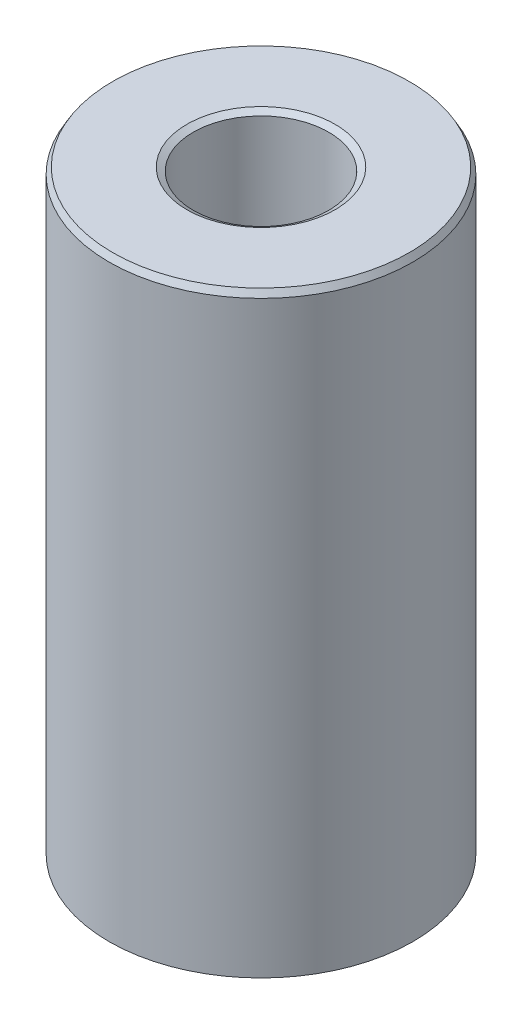
ISO-10303-21;
HEADER;
FILE_DESCRIPTION(('STEP AP214'),'2;1');
FILE_NAME('part.step','',(''),(''),'','','');
FILE_SCHEMA(('AUTOMOTIVE_DESIGN { 1 0 10303 214 1 1 1 1 }'));
ENDSEC;
DATA;
#1=APPLICATION_CONTEXT('core data for automotive mechanical design processes');
#2=APPLICATION_PROTOCOL_DEFINITION('international standard','automotive_design',2000,#1);
#3=PRODUCT_CONTEXT('',#1,'mechanical');
#4=PRODUCT('Part','Part','',(#3));
#5=PRODUCT_RELATED_PRODUCT_CATEGORY('part','',(#4));
#6=PRODUCT_DEFINITION_FORMATION('','',#4);
#7=PRODUCT_DEFINITION_CONTEXT('part definition',#1,'design');
#8=PRODUCT_DEFINITION('design','',#6,#7);
#9=PRODUCT_DEFINITION_SHAPE('','',#8);
#10=(LENGTH_UNIT() NAMED_UNIT(*) SI_UNIT(.MILLI.,.METRE.));
#11=(NAMED_UNIT(*) PLANE_ANGLE_UNIT() SI_UNIT($,.RADIAN.));
#12=(NAMED_UNIT(*) SI_UNIT($,.STERADIAN.) SOLID_ANGLE_UNIT());
#13=UNCERTAINTY_MEASURE_WITH_UNIT(LENGTH_MEASURE(1.E-05),#10,'distance_accuracy_value','');
#14=(GEOMETRIC_REPRESENTATION_CONTEXT(3) GLOBAL_UNCERTAINTY_ASSIGNED_CONTEXT((#13)) GLOBAL_UNIT_ASSIGNED_CONTEXT((#10,
#11,#12)) REPRESENTATION_CONTEXT('',''));
#15=CARTESIAN_POINT('',(0.,0.,0.));
#16=DIRECTION('',(0.,0.,1.));
#17=DIRECTION('',(1.,0.,0.));
#18=AXIS2_PLACEMENT_3D('',#15,#16,#17);
#19=CARTESIAN_POINT('',(0.,19.69420867426,0.));
#20=DIRECTION('',(0.,-1.,0.));
#21=DIRECTION('',(0.,0.,-1.));
#22=AXIS2_PLACEMENT_3D('',#19,#20,#21);
#23=CYLINDRICAL_SURFACE('',#22,5.);
#24=CARTESIAN_POINT('',(0.,0.120527176722118,0.));
#25=DIRECTION('',(0.,1.,0.));
#26=DIRECTION('',(0.,0.,1.));
#27=AXIS2_PLACEMENT_3D('',#24,#25,#26);
#28=CIRCLE('',#27,5.);
#29=CARTESIAN_POINT('',(0.,0.120527176722118,5.));
#30=VERTEX_POINT('',#29);
#31=EDGE_CURVE('E10',#30,#30,#28,.T.);
#32=ORIENTED_EDGE('',*,*,#31,.T.);
#33=EDGE_LOOP('',(#32));
#34=FACE_BOUND('',#33,.T.);
#35=CARTESIAN_POINT('',(0.,19.4854494804845,0.));
#36=DIRECTION('',(0.,1.,0.));
#37=DIRECTION('',(0.,0.,1.));
#38=AXIS2_PLACEMENT_3D('',#35,#36,#37);
#39=CIRCLE('',#38,5.);
#40=CARTESIAN_POINT('',(0.,19.4854494804845,5.));
#41=VERTEX_POINT('',#40);
#42=EDGE_CURVE('E50',#41,#41,#39,.F.);
#43=ORIENTED_EDGE('',*,*,#42,.T.);
#44=EDGE_LOOP('',(#43));
#45=FACE_BOUND('',#44,.T.);
#46=ADVANCED_FACE('F39',(#34,#45),#23,.T.);
#47=CARTESIAN_POINT('',(0.,19.69420867426,0.));
#48=DIRECTION('',(0.,1.,0.));
#49=DIRECTION('',(0.,0.,1.));
#50=AXIS2_PLACEMENT_3D('',#47,#48,#49);
#51=PLANE('',#50);
#52=CARTESIAN_POINT('',(0.,19.69420867426,0.));
#53=DIRECTION('',(0.,1.,0.));
#54=DIRECTION('',(0.,0.,1.));
#55=AXIS2_PLACEMENT_3D('',#52,#53,#54);
#56=CIRCLE('',#55,2.43810230074038);
#57=CARTESIAN_POINT('',(0.,19.69420867426,2.43810230074038));
#58=VERTEX_POINT('',#57);
#59=EDGE_CURVE('E58',#58,#58,#56,.F.);
#60=ORIENTED_EDGE('',*,*,#59,.T.);
#61=EDGE_LOOP('',(#60));
#62=FACE_BOUND('',#61,.T.);
#63=CARTESIAN_POINT('',(0.,19.69420867426,0.));
#64=DIRECTION('',(0.,1.,0.));
#65=DIRECTION('',(0.,0.,1.));
#66=AXIS2_PLACEMENT_3D('',#63,#64,#65);
#67=CIRCLE('',#66,4.87947282327788);
#68=CARTESIAN_POINT('',(0.,19.69420867426,4.87947282327788));
#69=VERTEX_POINT('',#68);
#70=EDGE_CURVE('E61',#69,#69,#67,.T.);
#71=ORIENTED_EDGE('',*,*,#70,.T.);
#72=EDGE_LOOP('',(#71));
#73=FACE_BOUND('',#72,.T.);
#74=ADVANCED_FACE('F88',(#62,#73),#51,.T.);
#75=CARTESIAN_POINT('',(0.,0.,0.));
#76=DIRECTION('',(0.,1.,0.));
#77=DIRECTION('',(0.,0.,1.));
#78=AXIS2_PLACEMENT_3D('',#75,#76,#77);
#79=PLANE('',#78);
#80=CARTESIAN_POINT('',(0.,0.,0.));
#81=DIRECTION('',(0.,1.,0.));
#82=DIRECTION('',(0.,0.,1.));
#83=AXIS2_PLACEMENT_3D('',#80,#81,#82);
#84=CIRCLE('',#83,2.34987028368695);
#85=CARTESIAN_POINT('',(0.,0.,2.34987028368695));
#86=VERTEX_POINT('',#85);
#87=EDGE_CURVE('E51',#86,#86,#84,.T.);
#88=ORIENTED_EDGE('',*,*,#87,.T.);
#89=EDGE_LOOP('',(#88));
#90=FACE_BOUND('',#89,.T.);
#91=CARTESIAN_POINT('',(0.,0.,0.));
#92=DIRECTION('',(0.,1.,0.));
#93=DIRECTION('',(0.,0.,1.));
#94=AXIS2_PLACEMENT_3D('',#91,#92,#93);
#95=CIRCLE('',#94,4.79124080622446);
#96=CARTESIAN_POINT('',(0.,0.,4.79124080622446));
#97=VERTEX_POINT('',#96);
#98=EDGE_CURVE('E54',#97,#97,#95,.F.);
#99=ORIENTED_EDGE('',*,*,#98,.T.);
#100=EDGE_LOOP('',(#99));
#101=FACE_BOUND('',#100,.T.);
#102=ADVANCED_FACE('F83',(#90,#101),#79,.F.);
#103=CARTESIAN_POINT('',(0.,19.69420867426,0.));
#104=DIRECTION('',(0.,-1.,0.));
#105=DIRECTION('',(0.,0.,-1.));
#106=AXIS2_PLACEMENT_3D('',#103,#104,#105);
#107=CYLINDRICAL_SURFACE('',#106,2.22934310696483);
#108=CARTESIAN_POINT('',(0.,19.5736814975379,0.));
#109=DIRECTION('',(0.,1.,0.));
#110=DIRECTION('',(0.,0.,1.));
#111=AXIS2_PLACEMENT_3D('',#108,#109,#110);
#112=CIRCLE('',#111,2.22934310696483);
#113=CARTESIAN_POINT('',(0.,19.5736814975379,2.22934310696483));
#114=VERTEX_POINT('',#113);
#115=EDGE_CURVE('E67',#114,#114,#112,.T.);
#116=ORIENTED_EDGE('',*,*,#115,.T.);
#117=EDGE_LOOP('',(#116));
#118=FACE_BOUND('',#117,.T.);
#119=CARTESIAN_POINT('',(0.,0.20875919377554,0.));
#120=DIRECTION('',(0.,1.,0.));
#121=DIRECTION('',(0.,0.,1.));
#122=AXIS2_PLACEMENT_3D('',#119,#120,#121);
#123=CIRCLE('',#122,2.22934310696483);
#124=CARTESIAN_POINT('',(0.,0.20875919377554,2.22934310696483));
#125=VERTEX_POINT('',#124);
#126=EDGE_CURVE('E69',#125,#125,#123,.F.);
#127=ORIENTED_EDGE('',*,*,#126,.T.);
#128=EDGE_LOOP('',(#127));
#129=FACE_BOUND('',#128,.T.);
#130=ADVANCED_FACE('F71',(#118,#129),#107,.F.);
#131=CARTESIAN_POINT('',(0.,19.5736814975379,0.));
#132=DIRECTION('',(0.,1.,0.));
#133=DIRECTION('',(0.,0.,1.));
#134=AXIS2_PLACEMENT_3D('',#131,#132,#133);
#135=CONICAL_SURFACE('',#134,2.22934310696483,1.04719755119661);
#136=ORIENTED_EDGE('',*,*,#59,.F.);
#137=EDGE_LOOP('',(#136));
#138=FACE_BOUND('',#137,.T.);
#139=ORIENTED_EDGE('',*,*,#115,.F.);
#140=EDGE_LOOP('',(#139));
#141=FACE_BOUND('',#140,.T.);
#142=ADVANCED_FACE('F77',(#138,#141),#135,.F.);
#143=CARTESIAN_POINT('',(0.,0.,0.));
#144=DIRECTION('',(0.,-1.,0.));
#145=DIRECTION('',(0.,0.,-1.));
#146=AXIS2_PLACEMENT_3D('',#143,#144,#145);
#147=CONICAL_SURFACE('',#146,2.34987028368695,0.523598775598292);
#148=ORIENTED_EDGE('',*,*,#126,.F.);
#149=EDGE_LOOP('',(#148));
#150=FACE_BOUND('',#149,.T.);
#151=ORIENTED_EDGE('',*,*,#87,.F.);
#152=EDGE_LOOP('',(#151));
#153=FACE_BOUND('',#152,.T.);
#154=ADVANCED_FACE('F73',(#150,#153),#147,.F.);
#155=CARTESIAN_POINT('',(0.,0.120527176722118,0.));
#156=DIRECTION('',(0.,1.,0.));
#157=DIRECTION('',(0.,0.,1.));
#158=AXIS2_PLACEMENT_3D('',#155,#156,#157);
#159=CONICAL_SURFACE('',#158,5.,1.04719755119659);
#160=ORIENTED_EDGE('',*,*,#98,.F.);
#161=EDGE_LOOP('',(#160));
#162=FACE_BOUND('',#161,.T.);
#163=ORIENTED_EDGE('',*,*,#31,.F.);
#164=EDGE_LOOP('',(#163));
#165=FACE_BOUND('',#164,.T.);
#166=ADVANCED_FACE('F76',(#162,#165),#159,.T.);
#167=CARTESIAN_POINT('',(0.,19.69420867426,0.));
#168=DIRECTION('',(0.,-1.,0.));
#169=DIRECTION('',(0.,0.,-1.));
#170=AXIS2_PLACEMENT_3D('',#167,#168,#169);
#171=CONICAL_SURFACE('',#170,4.87947282327788,0.523598775598293);
#172=ORIENTED_EDGE('',*,*,#42,.F.);
#173=EDGE_LOOP('',(#172));
#174=FACE_BOUND('',#173,.T.);
#175=ORIENTED_EDGE('',*,*,#70,.F.);
#176=EDGE_LOOP('',(#175));
#177=FACE_BOUND('',#176,.T.);
#178=ADVANCED_FACE('F45',(#174,#177),#171,.T.);
#179=CLOSED_SHELL('',(#46,#74,#102,#130,#142,#154,#166,#178));
#180=MANIFOLD_SOLID_BREP('B2',#179);
#181=ADVANCED_BREP_SHAPE_REPRESENTATION('',(#18,#180),#14);
#182=SHAPE_DEFINITION_REPRESENTATION(#9,#181);
ENDSEC;
END-ISO-10303-21;
